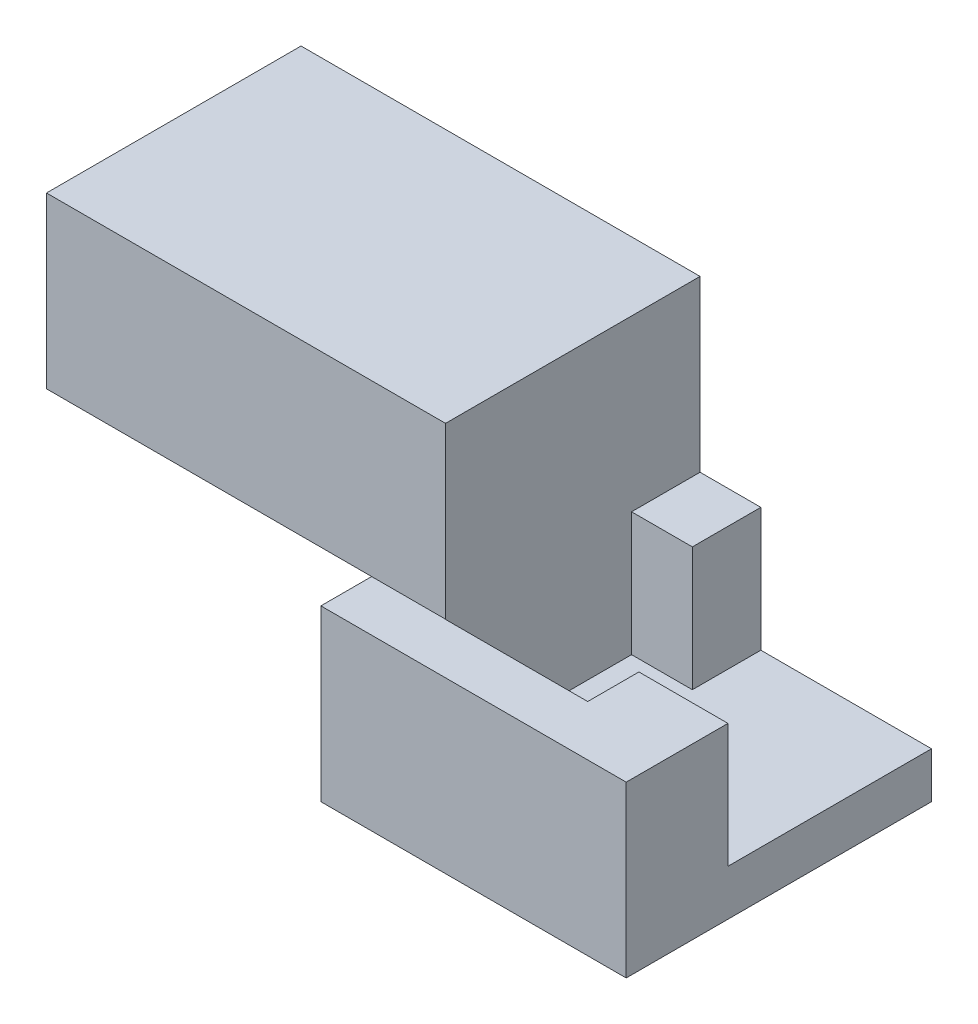
ISO-10303-21;
HEADER;
FILE_DESCRIPTION(('STEP AP214'),'2;1');
FILE_NAME('part.step','',(''),(''),'','','');
FILE_SCHEMA(('AUTOMOTIVE_DESIGN { 1 0 10303 214 1 1 1 1 }'));
ENDSEC;
DATA;
#1=APPLICATION_CONTEXT('core data for automotive mechanical design processes');
#2=APPLICATION_PROTOCOL_DEFINITION('international standard','automotive_design',2000,#1);
#3=PRODUCT_CONTEXT('',#1,'mechanical');
#4=PRODUCT('Part','Part','',(#3));
#5=PRODUCT_RELATED_PRODUCT_CATEGORY('part','',(#4));
#6=PRODUCT_DEFINITION_FORMATION('','',#4);
#7=PRODUCT_DEFINITION_CONTEXT('part definition',#1,'design');
#8=PRODUCT_DEFINITION('design','',#6,#7);
#9=PRODUCT_DEFINITION_SHAPE('','',#8);
#10=(LENGTH_UNIT() NAMED_UNIT(*) SI_UNIT(.MILLI.,.METRE.));
#11=(NAMED_UNIT(*) PLANE_ANGLE_UNIT() SI_UNIT($,.RADIAN.));
#12=(NAMED_UNIT(*) SI_UNIT($,.STERADIAN.) SOLID_ANGLE_UNIT());
#13=UNCERTAINTY_MEASURE_WITH_UNIT(LENGTH_MEASURE(1.E-05),#10,'distance_accuracy_value','');
#14=(GEOMETRIC_REPRESENTATION_CONTEXT(3) GLOBAL_UNCERTAINTY_ASSIGNED_CONTEXT((#13)) GLOBAL_UNIT_ASSIGNED_CONTEXT((#10,
#11,#12)) REPRESENTATION_CONTEXT('',''));
#15=CARTESIAN_POINT('',(0.,0.,0.));
#16=DIRECTION('',(0.,0.,1.));
#17=DIRECTION('',(1.,0.,0.));
#18=AXIS2_PLACEMENT_3D('',#15,#16,#17);
#19=CARTESIAN_POINT('',(0.,6.35,0.));
#20=DIRECTION('',(0.,-1.,0.));
#21=DIRECTION('',(0.,0.,-1.));
#22=AXIS2_PLACEMENT_3D('',#19,#20,#21);
#23=PLANE('',#22);
#24=DIRECTION('',(0.,0.,-1.));
#25=VECTOR('',#24,1.);
#26=CARTESIAN_POINT('',(2.76561903075156,6.35,-11.43));
#27=LINE('',#26,#25);
#28=CARTESIAN_POINT('',(2.76561903075156,6.35,-8.86565978482948));
#29=VERTEX_POINT('',#28);
#30=CARTESIAN_POINT('',(2.76561903075156,6.35,-11.43));
#31=VERTEX_POINT('',#30);
#32=EDGE_CURVE('E11',#29,#31,#27,.T.);
#33=ORIENTED_EDGE('',*,*,#32,.F.);
#34=DIRECTION('',(-1.,0.,0.));
#35=VECTOR('',#34,1.);
#36=CARTESIAN_POINT('',(0.,6.35,-8.86565978482948));
#37=LINE('',#36,#35);
#38=CARTESIAN_POINT('',(5.04058401058402,6.35,-8.86565978482948));
#39=VERTEX_POINT('',#38);
#40=EDGE_CURVE('E194',#39,#29,#37,.T.);
#41=ORIENTED_EDGE('',*,*,#40,.F.);
#42=DIRECTION('',(0.,0.,-1.));
#43=VECTOR('',#42,1.);
#44=CARTESIAN_POINT('',(5.04058401058402,6.35,-3.81));
#45=LINE('',#44,#43);
#46=CARTESIAN_POINT('',(5.04058401058402,6.35,-11.43));
#47=VERTEX_POINT('',#46);
#48=EDGE_CURVE('E212',#39,#47,#45,.T.);
#49=ORIENTED_EDGE('',*,*,#48,.T.);
#50=DIRECTION('',(-1.,0.,0.));
#51=VECTOR('',#50,1.);
#52=CARTESIAN_POINT('',(0.,6.35,-11.43));
#53=LINE('',#52,#51);
#54=EDGE_CURVE('E59',#47,#31,#53,.T.);
#55=ORIENTED_EDGE('',*,*,#54,.T.);
#56=EDGE_LOOP('',(#33,#41,#49,#55));
#57=FACE_BOUND('',#56,.T.);
#58=ADVANCED_FACE('F35',(#57),#23,.F.);
#59=DIRECTION('',(1.,0.,0.));
#60=VECTOR('',#59,1.);
#61=CARTESIAN_POINT('',(2.76561903075156,6.35,-1.90050860206657));
#62=LINE('',#61,#60);
#63=CARTESIAN_POINT('',(0.,6.35,-1.90050860206657));
#64=VERTEX_POINT('',#63);
#65=CARTESIAN_POINT('',(2.76561903075156,6.35,-1.90050860206657));
#66=VERTEX_POINT('',#65);
#67=EDGE_CURVE('E44',#64,#66,#62,.T.);
#68=ORIENTED_EDGE('',*,*,#67,.F.);
#69=DIRECTION('',(0.,0.,1.));
#70=VECTOR('',#69,1.);
#71=CARTESIAN_POINT('',(0.,6.35,0.));
#72=LINE('',#71,#70);
#73=CARTESIAN_POINT('',(0.,6.35,0.));
#74=VERTEX_POINT('',#73);
#75=EDGE_CURVE('E222',#64,#74,#72,.T.);
#76=ORIENTED_EDGE('',*,*,#75,.T.);
#77=DIRECTION('',(1.,0.,0.));
#78=VECTOR('',#77,1.);
#79=CARTESIAN_POINT('',(0.,6.35,0.));
#80=LINE('',#79,#78);
#81=CARTESIAN_POINT('',(11.43,6.35,0.));
#82=VERTEX_POINT('',#81);
#83=EDGE_CURVE('E221',#74,#82,#80,.T.);
#84=ORIENTED_EDGE('',*,*,#83,.T.);
#85=DIRECTION('',(0.,0.,-1.));
#86=VECTOR('',#85,1.);
#87=CARTESIAN_POINT('',(11.43,6.35,0.));
#88=LINE('',#87,#86);
#89=CARTESIAN_POINT('',(11.43,6.35,-3.81));
#90=VERTEX_POINT('',#89);
#91=EDGE_CURVE('E224',#82,#90,#88,.T.);
#92=ORIENTED_EDGE('',*,*,#91,.T.);
#93=DIRECTION('',(1.,0.,0.));
#94=VECTOR('',#93,1.);
#95=CARTESIAN_POINT('',(11.43,6.35,-3.81));
#96=LINE('',#95,#94);
#97=CARTESIAN_POINT('',(8.09576768050974,6.35,-3.81));
#98=VERTEX_POINT('',#97);
#99=EDGE_CURVE('E205',#98,#90,#96,.T.);
#100=ORIENTED_EDGE('',*,*,#99,.F.);
#101=DIRECTION('',(0.,0.,-1.));
#102=VECTOR('',#101,1.);
#103=CARTESIAN_POINT('',(8.09576768050974,6.35,0.));
#104=LINE('',#103,#102);
#105=CARTESIAN_POINT('',(8.09576768050974,6.35,-1.89310710134671));
#106=VERTEX_POINT('',#105);
#107=EDGE_CURVE('E190',#106,#98,#104,.T.);
#108=ORIENTED_EDGE('',*,*,#107,.F.);
#109=DIRECTION('',(1.,0.,0.));
#110=VECTOR('',#109,1.);
#111=CARTESIAN_POINT('',(0.,6.35,-1.89310710134671));
#112=LINE('',#111,#110);
#113=CARTESIAN_POINT('',(2.76561903075156,6.35,-1.89310710134671));
#114=VERTEX_POINT('',#113);
#115=EDGE_CURVE('E39',#114,#106,#112,.T.);
#116=ORIENTED_EDGE('',*,*,#115,.F.);
#117=DIRECTION('',(0.,0.,1.));
#118=VECTOR('',#117,1.);
#119=CARTESIAN_POINT('',(2.76561903075156,6.35,0.));
#120=LINE('',#119,#118);
#121=EDGE_CURVE('E250',#66,#114,#120,.T.);
#122=ORIENTED_EDGE('',*,*,#121,.F.);
#123=EDGE_LOOP('',(#68,#76,#84,#92,#100,#108,#116,#122));
#124=FACE_BOUND('',#123,.T.);
#125=ADVANCED_FACE('F285',(#124),#23,.F.);
#126=CARTESIAN_POINT('',(5.04058401058402,6.35,-3.81));
#127=DIRECTION('',(-1.,0.,0.));
#128=DIRECTION('',(0.,0.,1.));
#129=AXIS2_PLACEMENT_3D('',#126,#127,#128);
#130=PLANE('',#129);
#131=DIRECTION('',(0.,1.,0.));
#132=VECTOR('',#131,1.);
#133=CARTESIAN_POINT('',(5.04058401058402,6.35,-8.86565978482948));
#134=LINE('',#133,#132);
#135=CARTESIAN_POINT('',(5.04058401058402,1.71804989691226,-8.86565978482948));
#136=VERTEX_POINT('',#135);
#137=EDGE_CURVE('E192',#136,#39,#134,.T.);
#138=ORIENTED_EDGE('',*,*,#137,.F.);
#139=DIRECTION('',(0.,0.,-1.));
#140=VECTOR('',#139,1.);
#141=CARTESIAN_POINT('',(5.04058401058402,1.71804989691226,-3.81));
#142=LINE('',#141,#140);
#143=CARTESIAN_POINT('',(5.04058401058402,1.71804989691226,-11.43));
#144=VERTEX_POINT('',#143);
#145=EDGE_CURVE('E215',#136,#144,#142,.T.);
#146=ORIENTED_EDGE('',*,*,#145,.T.);
#147=DIRECTION('',(0.,1.,0.));
#148=VECTOR('',#147,1.);
#149=CARTESIAN_POINT('',(5.04058401058402,6.35,-11.43));
#150=LINE('',#149,#148);
#151=EDGE_CURVE('E202',#144,#47,#150,.T.);
#152=ORIENTED_EDGE('',*,*,#151,.T.);
#153=ORIENTED_EDGE('',*,*,#48,.F.);
#154=EDGE_LOOP('',(#138,#146,#152,#153));
#155=FACE_BOUND('',#154,.T.);
#156=ADVANCED_FACE('F290',(#155),#130,.F.);
#157=CARTESIAN_POINT('',(0.,0.,-3.81));
#158=DIRECTION('',(0.,0.,-1.));
#159=DIRECTION('',(-1.,0.,0.));
#160=AXIS2_PLACEMENT_3D('',#157,#158,#159);
#161=PLANE('',#160);
#162=DIRECTION('',(-1.,0.,0.));
#163=VECTOR('',#162,1.);
#164=CARTESIAN_POINT('',(11.43,1.71804989691226,-3.81));
#165=LINE('',#164,#163);
#166=CARTESIAN_POINT('',(11.43,1.71804989691226,-3.81));
#167=VERTEX_POINT('',#166);
#168=CARTESIAN_POINT('',(8.09576768050974,1.71804989691226,-3.81));
#169=VERTEX_POINT('',#168);
#170=EDGE_CURVE('E201',#167,#169,#165,.T.);
#171=ORIENTED_EDGE('',*,*,#170,.T.);
#172=DIRECTION('',(0.,1.,0.));
#173=VECTOR('',#172,1.);
#174=CARTESIAN_POINT('',(8.09576768050974,0.,-3.81));
#175=LINE('',#174,#173);
#176=EDGE_CURVE('E248',#169,#98,#175,.T.);
#177=ORIENTED_EDGE('',*,*,#176,.T.);
#178=ORIENTED_EDGE('',*,*,#99,.T.);
#179=DIRECTION('',(0.,-1.,0.));
#180=VECTOR('',#179,1.);
#181=CARTESIAN_POINT('',(11.43,6.35,-3.81));
#182=LINE('',#181,#180);
#183=EDGE_CURVE('E198',#90,#167,#182,.T.);
#184=ORIENTED_EDGE('',*,*,#183,.T.);
#185=EDGE_LOOP('',(#171,#177,#178,#184));
#186=FACE_BOUND('',#185,.T.);
#187=ADVANCED_FACE('F310',(#186),#161,.T.);
#188=CARTESIAN_POINT('',(0.,6.35,0.));
#189=DIRECTION('',(1.,0.,0.));
#190=DIRECTION('',(0.,0.,-1.));
#191=AXIS2_PLACEMENT_3D('',#188,#189,#190);
#192=PLANE('',#191);
#193=DIRECTION('',(0.,0.,1.));
#194=VECTOR('',#193,1.);
#195=CARTESIAN_POINT('',(0.,0.,0.));
#196=LINE('',#195,#194);
#197=CARTESIAN_POINT('',(0.,0.,-11.43));
#198=VERTEX_POINT('',#197);
#199=CARTESIAN_POINT('',(0.,0.,0.));
#200=VERTEX_POINT('',#199);
#201=EDGE_CURVE('E214',#198,#200,#196,.T.);
#202=ORIENTED_EDGE('',*,*,#201,.T.);
#203=DIRECTION('',(0.,-1.,0.));
#204=VECTOR('',#203,1.);
#205=CARTESIAN_POINT('',(0.,6.35,0.));
#206=LINE('',#205,#204);
#207=EDGE_CURVE('E245',#74,#200,#206,.T.);
#208=ORIENTED_EDGE('',*,*,#207,.F.);
#209=ORIENTED_EDGE('',*,*,#75,.F.);
#210=CARTESIAN_POINT('',(0.,6.35,-11.43));
#211=VERTEX_POINT('',#210);
#212=EDGE_CURVE('E218',#211,#64,#72,.T.);
#213=ORIENTED_EDGE('',*,*,#212,.F.);
#214=DIRECTION('',(0.,-1.,0.));
#215=VECTOR('',#214,1.);
#216=CARTESIAN_POINT('',(0.,6.35,-11.43));
#217=LINE('',#216,#215);
#218=EDGE_CURVE('E228',#211,#198,#217,.T.);
#219=ORIENTED_EDGE('',*,*,#218,.T.);
#220=EDGE_LOOP('',(#202,#208,#209,#213,#219));
#221=FACE_BOUND('',#220,.T.);
#222=ADVANCED_FACE('F37',(#221),#192,.F.);
#223=CARTESIAN_POINT('',(0.,6.35,0.));
#224=DIRECTION('',(0.,0.,-1.));
#225=DIRECTION('',(-1.,0.,0.));
#226=AXIS2_PLACEMENT_3D('',#223,#224,#225);
#227=PLANE('',#226);
#228=DIRECTION('',(1.,0.,0.));
#229=VECTOR('',#228,1.);
#230=CARTESIAN_POINT('',(0.,0.,0.));
#231=LINE('',#230,#229);
#232=CARTESIAN_POINT('',(11.43,0.,0.));
#233=VERTEX_POINT('',#232);
#234=EDGE_CURVE('E231',#200,#233,#231,.T.);
#235=ORIENTED_EDGE('',*,*,#234,.T.);
#236=DIRECTION('',(0.,-1.,0.));
#237=VECTOR('',#236,1.);
#238=CARTESIAN_POINT('',(11.43,6.35,0.));
#239=LINE('',#238,#237);
#240=EDGE_CURVE('E242',#82,#233,#239,.T.);
#241=ORIENTED_EDGE('',*,*,#240,.F.);
#242=ORIENTED_EDGE('',*,*,#83,.F.);
#243=ORIENTED_EDGE('',*,*,#207,.T.);
#244=EDGE_LOOP('',(#235,#241,#242,#243));
#245=FACE_BOUND('',#244,.T.);
#246=ADVANCED_FACE('F303',(#245),#227,.F.);
#247=CARTESIAN_POINT('',(11.43,6.35,0.));
#248=DIRECTION('',(-1.,0.,0.));
#249=DIRECTION('',(0.,0.,1.));
#250=AXIS2_PLACEMENT_3D('',#247,#248,#249);
#251=PLANE('',#250);
#252=DIRECTION('',(0.,-1.,0.));
#253=VECTOR('',#252,1.);
#254=CARTESIAN_POINT('',(11.43,6.35,-11.43));
#255=LINE('',#254,#253);
#256=CARTESIAN_POINT('',(11.43,1.71804989691226,-11.43));
#257=VERTEX_POINT('',#256);
#258=CARTESIAN_POINT('',(11.43,0.,-11.43));
#259=VERTEX_POINT('',#258);
#260=EDGE_CURVE('E240',#257,#259,#255,.T.);
#261=ORIENTED_EDGE('',*,*,#260,.F.);
#262=DIRECTION('',(0.,0.,-1.));
#263=VECTOR('',#262,1.);
#264=CARTESIAN_POINT('',(11.43,1.71804989691226,-3.81));
#265=LINE('',#264,#263);
#266=EDGE_CURVE('E207',#167,#257,#265,.T.);
#267=ORIENTED_EDGE('',*,*,#266,.F.);
#268=ORIENTED_EDGE('',*,*,#183,.F.);
#269=ORIENTED_EDGE('',*,*,#91,.F.);
#270=ORIENTED_EDGE('',*,*,#240,.T.);
#271=DIRECTION('',(0.,0.,-1.));
#272=VECTOR('',#271,1.);
#273=CARTESIAN_POINT('',(11.43,0.,0.));
#274=LINE('',#273,#272);
#275=EDGE_CURVE('E233',#233,#259,#274,.T.);
#276=ORIENTED_EDGE('',*,*,#275,.T.);
#277=EDGE_LOOP('',(#261,#267,#268,#269,#270,#276));
#278=FACE_BOUND('',#277,.T.);
#279=ADVANCED_FACE('F301',(#278),#251,.F.);
#280=CARTESIAN_POINT('',(0.,6.35,-11.43));
#281=DIRECTION('',(0.,0.,1.));
#282=DIRECTION('',(1.,0.,0.));
#283=AXIS2_PLACEMENT_3D('',#280,#281,#282);
#284=PLANE('',#283);
#285=ORIENTED_EDGE('',*,*,#54,.F.);
#286=ORIENTED_EDGE('',*,*,#151,.F.);
#287=DIRECTION('',(-1.,0.,0.));
#288=VECTOR('',#287,1.);
#289=CARTESIAN_POINT('',(11.43,1.71804989691226,-11.43));
#290=LINE('',#289,#288);
#291=EDGE_CURVE('E197',#257,#144,#290,.T.);
#292=ORIENTED_EDGE('',*,*,#291,.F.);
#293=ORIENTED_EDGE('',*,*,#260,.T.);
#294=DIRECTION('',(-1.,0.,0.));
#295=VECTOR('',#294,1.);
#296=CARTESIAN_POINT('',(0.,0.,-11.43));
#297=LINE('',#296,#295);
#298=EDGE_CURVE('E236',#259,#198,#297,.T.);
#299=ORIENTED_EDGE('',*,*,#298,.T.);
#300=ORIENTED_EDGE('',*,*,#218,.F.);
#301=DIRECTION('',(-1.,0.,0.));
#302=VECTOR('',#301,1.);
#303=CARTESIAN_POINT('',(2.76561903075156,6.35,-11.43));
#304=LINE('',#303,#302);
#305=CARTESIAN_POINT('',(-12.1728598973787,6.35,-11.43));
#306=VERTEX_POINT('',#305);
#307=EDGE_CURVE('E263',#211,#306,#304,.T.);
#308=ORIENTED_EDGE('',*,*,#307,.T.);
#309=DIRECTION('',(0.,-1.,0.));
#310=VECTOR('',#309,1.);
#311=CARTESIAN_POINT('',(-12.1728598973787,12.7,-11.43));
#312=LINE('',#311,#310);
#313=CARTESIAN_POINT('',(-12.1728598973787,12.7,-11.43));
#314=VERTEX_POINT('',#313);
#315=EDGE_CURVE('E151',#314,#306,#312,.T.);
#316=ORIENTED_EDGE('',*,*,#315,.F.);
#317=DIRECTION('',(-1.,0.,0.));
#318=VECTOR('',#317,1.);
#319=CARTESIAN_POINT('',(2.76561903075156,12.7,-11.43));
#320=LINE('',#319,#318);
#321=CARTESIAN_POINT('',(2.76561903075156,12.7,-11.43));
#322=VERTEX_POINT('',#321);
#323=EDGE_CURVE('E145',#322,#314,#320,.T.);
#324=ORIENTED_EDGE('',*,*,#323,.F.);
#325=DIRECTION('',(0.,-1.,0.));
#326=VECTOR('',#325,1.);
#327=CARTESIAN_POINT('',(2.76561903075156,12.7,-11.43));
#328=LINE('',#327,#326);
#329=EDGE_CURVE('E149',#322,#31,#328,.T.);
#330=ORIENTED_EDGE('',*,*,#329,.T.);
#331=EDGE_LOOP('',(#285,#286,#292,#293,#299,#300,#308,#316,#324,#330));
#332=FACE_BOUND('',#331,.T.);
#333=ADVANCED_FACE('F147',(#332),#284,.F.);
#334=CARTESIAN_POINT('',(0.,0.,0.));
#335=DIRECTION('',(0.,-1.,0.));
#336=DIRECTION('',(0.,0.,-1.));
#337=AXIS2_PLACEMENT_3D('',#334,#335,#336);
#338=PLANE('',#337);
#339=ORIENTED_EDGE('',*,*,#201,.F.);
#340=ORIENTED_EDGE('',*,*,#298,.F.);
#341=ORIENTED_EDGE('',*,*,#275,.F.);
#342=ORIENTED_EDGE('',*,*,#234,.F.);
#343=EDGE_LOOP('',(#339,#340,#341,#342));
#344=FACE_BOUND('',#343,.T.);
#345=ADVANCED_FACE('F295',(#344),#338,.T.);
#346=CARTESIAN_POINT('',(11.43,1.71804989691226,-3.81));
#347=DIRECTION('',(0.,-1.,0.));
#348=DIRECTION('',(0.,0.,-1.));
#349=AXIS2_PLACEMENT_3D('',#346,#347,#348);
#350=PLANE('',#349);
#351=ORIENTED_EDGE('',*,*,#145,.F.);
#352=DIRECTION('',(-1.,0.,0.));
#353=VECTOR('',#352,1.);
#354=CARTESIAN_POINT('',(2.76561903075156,1.71804989691226,-8.86565978482948));
#355=LINE('',#354,#353);
#356=CARTESIAN_POINT('',(2.76561903075156,1.71804989691226,-8.86565978482948));
#357=VERTEX_POINT('',#356);
#358=EDGE_CURVE('E181',#136,#357,#355,.T.);
#359=ORIENTED_EDGE('',*,*,#358,.T.);
#360=DIRECTION('',(0.,0.,1.));
#361=VECTOR('',#360,1.);
#362=CARTESIAN_POINT('',(2.76561903075156,1.71804989691226,-8.86565978482948));
#363=LINE('',#362,#361);
#364=CARTESIAN_POINT('',(2.76561903075156,1.71804989691226,-1.89310710134671));
#365=VERTEX_POINT('',#364);
#366=EDGE_CURVE('E168',#357,#365,#363,.T.);
#367=ORIENTED_EDGE('',*,*,#366,.T.);
#368=DIRECTION('',(1.,0.,0.));
#369=VECTOR('',#368,1.);
#370=CARTESIAN_POINT('',(2.76561903075156,1.71804989691226,-1.89310710134671));
#371=LINE('',#370,#369);
#372=CARTESIAN_POINT('',(8.09576768050974,1.71804989691226,-1.89310710134671));
#373=VERTEX_POINT('',#372);
#374=EDGE_CURVE('E171',#365,#373,#371,.T.);
#375=ORIENTED_EDGE('',*,*,#374,.T.);
#376=DIRECTION('',(0.,0.,-1.));
#377=VECTOR('',#376,1.);
#378=CARTESIAN_POINT('',(8.09576768050974,1.71804989691226,-8.86565978482948));
#379=LINE('',#378,#377);
#380=EDGE_CURVE('E179',#373,#169,#379,.T.);
#381=ORIENTED_EDGE('',*,*,#380,.T.);
#382=ORIENTED_EDGE('',*,*,#170,.F.);
#383=ORIENTED_EDGE('',*,*,#266,.T.);
#384=ORIENTED_EDGE('',*,*,#291,.T.);
#385=EDGE_LOOP('',(#351,#359,#367,#375,#381,#382,#383,#384));
#386=FACE_BOUND('',#385,.T.);
#387=ADVANCED_FACE('F293',(#386),#350,.F.);
#388=CARTESIAN_POINT('',(2.76561903075156,16.9580498969123,-8.86565978482948));
#389=DIRECTION('',(1.,0.,0.));
#390=DIRECTION('',(0.,0.,-1.));
#391=AXIS2_PLACEMENT_3D('',#388,#389,#390);
#392=PLANE('',#391);
#393=DIRECTION('',(0.,-1.,0.));
#394=VECTOR('',#393,1.);
#395=CARTESIAN_POINT('',(2.76561903075156,16.9580498969123,-8.86565978482948));
#396=LINE('',#395,#394);
#397=EDGE_CURVE('E184',#29,#357,#396,.T.);
#398=ORIENTED_EDGE('',*,*,#397,.F.);
#399=ORIENTED_EDGE('',*,*,#32,.T.);
#400=ORIENTED_EDGE('',*,*,#329,.F.);
#401=DIRECTION('',(0.,0.,-1.));
#402=VECTOR('',#401,1.);
#403=CARTESIAN_POINT('',(2.76561903075156,12.7,-11.43));
#404=LINE('',#403,#402);
#405=CARTESIAN_POINT('',(2.76561903075156,12.7,-1.90050860206657));
#406=VERTEX_POINT('',#405);
#407=EDGE_CURVE('E155',#406,#322,#404,.T.);
#408=ORIENTED_EDGE('',*,*,#407,.F.);
#409=DIRECTION('',(0.,-1.,0.));
#410=VECTOR('',#409,1.);
#411=CARTESIAN_POINT('',(2.76561903075156,12.7,-1.90050860206657));
#412=LINE('',#411,#410);
#413=EDGE_CURVE('E270',#406,#66,#412,.T.);
#414=ORIENTED_EDGE('',*,*,#413,.T.);
#415=ORIENTED_EDGE('',*,*,#121,.T.);
#416=DIRECTION('',(0.,-1.,0.));
#417=VECTOR('',#416,1.);
#418=CARTESIAN_POINT('',(2.76561903075156,16.9580498969123,-1.89310710134671));
#419=LINE('',#418,#417);
#420=EDGE_CURVE('E188',#114,#365,#419,.T.);
#421=ORIENTED_EDGE('',*,*,#420,.T.);
#422=ORIENTED_EDGE('',*,*,#366,.F.);
#423=EDGE_LOOP('',(#398,#399,#400,#408,#414,#415,#421,#422));
#424=FACE_BOUND('',#423,.T.);
#425=ADVANCED_FACE('F167',(#424),#392,.T.);
#426=CARTESIAN_POINT('',(2.76561903075156,16.9580498969123,-1.89310710134671));
#427=DIRECTION('',(0.,0.,-1.));
#428=DIRECTION('',(-1.,0.,0.));
#429=AXIS2_PLACEMENT_3D('',#426,#427,#428);
#430=PLANE('',#429);
#431=ORIENTED_EDGE('',*,*,#115,.T.);
#432=DIRECTION('',(0.,-1.,0.));
#433=VECTOR('',#432,1.);
#434=CARTESIAN_POINT('',(8.09576768050974,16.9580498969123,-1.89310710134671));
#435=LINE('',#434,#433);
#436=EDGE_CURVE('E186',#106,#373,#435,.T.);
#437=ORIENTED_EDGE('',*,*,#436,.T.);
#438=ORIENTED_EDGE('',*,*,#374,.F.);
#439=ORIENTED_EDGE('',*,*,#420,.F.);
#440=EDGE_LOOP('',(#431,#437,#438,#439));
#441=FACE_BOUND('',#440,.T.);
#442=ADVANCED_FACE('F354',(#441),#430,.T.);
#443=CARTESIAN_POINT('',(2.76561903075156,16.9580498969123,-8.86565978482948));
#444=DIRECTION('',(0.,0.,1.));
#445=DIRECTION('',(1.,0.,0.));
#446=AXIS2_PLACEMENT_3D('',#443,#444,#445);
#447=PLANE('',#446);
#448=ORIENTED_EDGE('',*,*,#40,.T.);
#449=ORIENTED_EDGE('',*,*,#397,.T.);
#450=ORIENTED_EDGE('',*,*,#358,.F.);
#451=ORIENTED_EDGE('',*,*,#137,.T.);
#452=EDGE_LOOP('',(#448,#449,#450,#451));
#453=FACE_BOUND('',#452,.T.);
#454=ADVANCED_FACE('F349',(#453),#447,.T.);
#455=CARTESIAN_POINT('',(8.09576768050974,16.9580498969123,-8.86565978482948));
#456=DIRECTION('',(-1.,0.,0.));
#457=DIRECTION('',(0.,0.,1.));
#458=AXIS2_PLACEMENT_3D('',#455,#456,#457);
#459=PLANE('',#458);
#460=ORIENTED_EDGE('',*,*,#107,.T.);
#461=ORIENTED_EDGE('',*,*,#176,.F.);
#462=ORIENTED_EDGE('',*,*,#380,.F.);
#463=ORIENTED_EDGE('',*,*,#436,.F.);
#464=EDGE_LOOP('',(#460,#461,#462,#463));
#465=FACE_BOUND('',#464,.T.);
#466=ADVANCED_FACE('F281',(#465),#459,.T.);
#467=CARTESIAN_POINT('',(-12.1728598973787,12.7,-11.43));
#468=DIRECTION('',(1.,0.,0.));
#469=DIRECTION('',(0.,0.,-1.));
#470=AXIS2_PLACEMENT_3D('',#467,#468,#469);
#471=PLANE('',#470);
#472=DIRECTION('',(0.,0.,1.));
#473=VECTOR('',#472,1.);
#474=CARTESIAN_POINT('',(-12.1728598973787,6.35,-11.43));
#475=LINE('',#474,#473);
#476=CARTESIAN_POINT('',(-12.1728598973787,6.35,-1.90050860206657));
#477=VERTEX_POINT('',#476);
#478=EDGE_CURVE('E260',#306,#477,#475,.T.);
#479=ORIENTED_EDGE('',*,*,#478,.T.);
#480=DIRECTION('',(0.,-1.,0.));
#481=VECTOR('',#480,1.);
#482=CARTESIAN_POINT('',(-12.1728598973787,12.7,-1.90050860206657));
#483=LINE('',#482,#481);
#484=CARTESIAN_POINT('',(-12.1728598973787,12.7,-1.90050860206657));
#485=VERTEX_POINT('',#484);
#486=EDGE_CURVE('E173',#485,#477,#483,.T.);
#487=ORIENTED_EDGE('',*,*,#486,.F.);
#488=DIRECTION('',(0.,0.,1.));
#489=VECTOR('',#488,1.);
#490=CARTESIAN_POINT('',(-12.1728598973787,12.7,-11.43));
#491=LINE('',#490,#489);
#492=EDGE_CURVE('E154',#314,#485,#491,.T.);
#493=ORIENTED_EDGE('',*,*,#492,.F.);
#494=ORIENTED_EDGE('',*,*,#315,.T.);
#495=EDGE_LOOP('',(#479,#487,#493,#494));
#496=FACE_BOUND('',#495,.T.);
#497=ADVANCED_FACE('F271',(#496),#471,.F.);
#498=CARTESIAN_POINT('',(2.76561903075156,12.7,-1.90050860206657));
#499=DIRECTION('',(0.,0.,-1.));
#500=DIRECTION('',(-1.,0.,0.));
#501=AXIS2_PLACEMENT_3D('',#498,#499,#500);
#502=PLANE('',#501);
#503=EDGE_CURVE('E164',#477,#64,#62,.T.);
#504=ORIENTED_EDGE('',*,*,#503,.T.);
#505=ORIENTED_EDGE('',*,*,#67,.T.);
#506=ORIENTED_EDGE('',*,*,#413,.F.);
#507=DIRECTION('',(1.,0.,0.));
#508=VECTOR('',#507,1.);
#509=CARTESIAN_POINT('',(2.76561903075156,12.7,-1.90050860206657));
#510=LINE('',#509,#508);
#511=EDGE_CURVE('E160',#485,#406,#510,.T.);
#512=ORIENTED_EDGE('',*,*,#511,.F.);
#513=ORIENTED_EDGE('',*,*,#486,.T.);
#514=EDGE_LOOP('',(#504,#505,#506,#512,#513));
#515=FACE_BOUND('',#514,.T.);
#516=ADVANCED_FACE('F272',(#515),#502,.F.);
#517=CARTESIAN_POINT('',(0.,12.7,0.));
#518=DIRECTION('',(0.,-1.,0.));
#519=DIRECTION('',(0.,0.,-1.));
#520=AXIS2_PLACEMENT_3D('',#517,#518,#519);
#521=PLANE('',#520);
#522=ORIENTED_EDGE('',*,*,#407,.T.);
#523=ORIENTED_EDGE('',*,*,#323,.T.);
#524=ORIENTED_EDGE('',*,*,#492,.T.);
#525=ORIENTED_EDGE('',*,*,#511,.T.);
#526=EDGE_LOOP('',(#522,#523,#524,#525));
#527=FACE_BOUND('',#526,.T.);
#528=ADVANCED_FACE('F158',(#527),#521,.F.);
#529=CARTESIAN_POINT('',(0.,6.35,0.));
#530=DIRECTION('',(0.,-1.,0.));
#531=DIRECTION('',(0.,0.,-1.));
#532=AXIS2_PLACEMENT_3D('',#529,#530,#531);
#533=PLANE('',#532);
#534=ORIENTED_EDGE('',*,*,#307,.F.);
#535=ORIENTED_EDGE('',*,*,#212,.T.);
#536=ORIENTED_EDGE('',*,*,#503,.F.);
#537=ORIENTED_EDGE('',*,*,#478,.F.);
#538=EDGE_LOOP('',(#534,#535,#536,#537));
#539=FACE_BOUND('',#538,.T.);
#540=ADVANCED_FACE('F279',(#539),#533,.T.);
#541=CLOSED_SHELL('',(#58,#125,#156,#187,#222,#246,#279,#333,#345,#387,#425,#442,#454,#466,#497,
#516,#528,#540));
#542=MANIFOLD_SOLID_BREP('B2',#541);
#543=ADVANCED_BREP_SHAPE_REPRESENTATION('',(#18,#542),#14);
#544=SHAPE_DEFINITION_REPRESENTATION(#9,#543);
ENDSEC;
END-ISO-10303-21;
